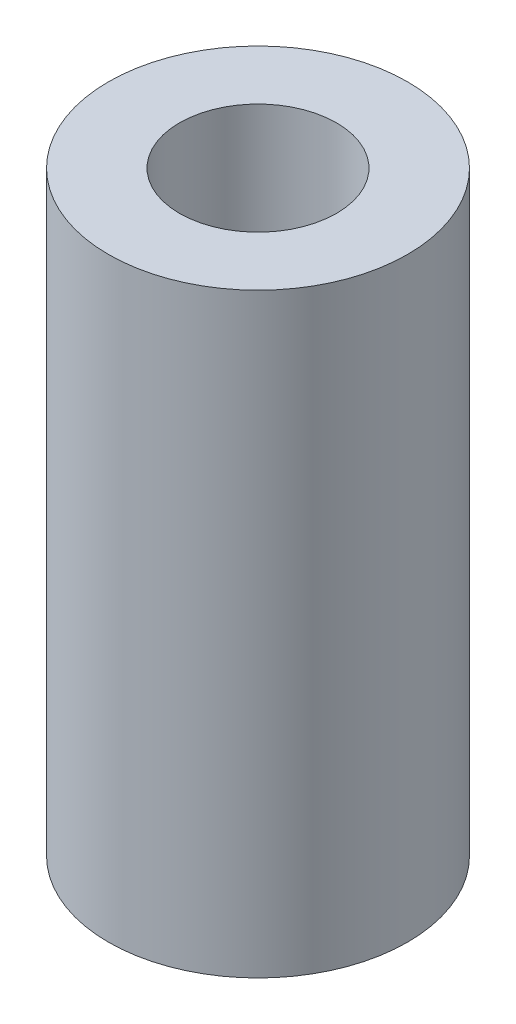
ISO-10303-21;
HEADER;
FILE_DESCRIPTION(('STEP AP214'),'2;1');
FILE_NAME('part.step','',(''),(''),'','','');
FILE_SCHEMA(('AUTOMOTIVE_DESIGN { 1 0 10303 214 1 1 1 1 }'));
ENDSEC;
DATA;
#1=APPLICATION_CONTEXT('core data for automotive mechanical design processes');
#2=APPLICATION_PROTOCOL_DEFINITION('international standard','automotive_design',2000,#1);
#3=PRODUCT_CONTEXT('',#1,'mechanical');
#4=PRODUCT('Part','Part','',(#3));
#5=PRODUCT_RELATED_PRODUCT_CATEGORY('part','',(#4));
#6=PRODUCT_DEFINITION_FORMATION('','',#4);
#7=PRODUCT_DEFINITION_CONTEXT('part definition',#1,'design');
#8=PRODUCT_DEFINITION('design','',#6,#7);
#9=PRODUCT_DEFINITION_SHAPE('','',#8);
#10=(LENGTH_UNIT() NAMED_UNIT(*) SI_UNIT(.MILLI.,.METRE.));
#11=(NAMED_UNIT(*) PLANE_ANGLE_UNIT() SI_UNIT($,.RADIAN.));
#12=(NAMED_UNIT(*) SI_UNIT($,.STERADIAN.) SOLID_ANGLE_UNIT());
#13=UNCERTAINTY_MEASURE_WITH_UNIT(LENGTH_MEASURE(1.E-05),#10,'distance_accuracy_value','');
#14=(GEOMETRIC_REPRESENTATION_CONTEXT(3) GLOBAL_UNCERTAINTY_ASSIGNED_CONTEXT((#13)) GLOBAL_UNIT_ASSIGNED_CONTEXT((#10,
#11,#12)) REPRESENTATION_CONTEXT('',''));
#15=CARTESIAN_POINT('',(0.,0.,0.));
#16=DIRECTION('',(0.,0.,1.));
#17=DIRECTION('',(1.,0.,0.));
#18=AXIS2_PLACEMENT_3D('',#15,#16,#17);
#19=CARTESIAN_POINT('',(0.,15.175,0.));
#20=DIRECTION('',(0.,1.,0.));
#21=DIRECTION('',(0.,0.,1.));
#22=AXIS2_PLACEMENT_3D('',#19,#20,#21);
#23=PLANE('',#22);
#24=CARTESIAN_POINT('',(0.,15.175,0.));
#25=DIRECTION('',(0.,1.,0.));
#26=DIRECTION('',(0.,0.,1.));
#27=AXIS2_PLACEMENT_3D('',#24,#25,#26);
#28=CIRCLE('',#27,3.81);
#29=CARTESIAN_POINT('',(0.,15.175,3.81));
#30=VERTEX_POINT('',#29);
#31=EDGE_CURVE('E10',#30,#30,#28,.T.);
#32=ORIENTED_EDGE('',*,*,#31,.T.);
#33=EDGE_LOOP('',(#32));
#34=FACE_BOUND('',#33,.T.);
#35=CARTESIAN_POINT('',(0.,15.175,0.));
#36=DIRECTION('',(0.,1.,0.));
#37=DIRECTION('',(0.,0.,1.));
#38=AXIS2_PLACEMENT_3D('',#35,#36,#37);
#39=CIRCLE('',#38,2.);
#40=CARTESIAN_POINT('',(0.,15.175,2.));
#41=VERTEX_POINT('',#40);
#42=EDGE_CURVE('E46',#41,#41,#39,.T.);
#43=ORIENTED_EDGE('',*,*,#42,.F.);
#44=EDGE_LOOP('',(#43));
#45=FACE_BOUND('',#44,.T.);
#46=ADVANCED_FACE('F35',(#34,#45),#23,.T.);
#47=CARTESIAN_POINT('',(0.,0.,0.));
#48=DIRECTION('',(0.,1.,0.));
#49=DIRECTION('',(0.,0.,1.));
#50=AXIS2_PLACEMENT_3D('',#47,#48,#49);
#51=PLANE('',#50);
#52=CARTESIAN_POINT('',(0.,0.,0.));
#53=DIRECTION('',(0.,1.,0.));
#54=DIRECTION('',(0.,0.,1.));
#55=AXIS2_PLACEMENT_3D('',#52,#53,#54);
#56=CIRCLE('',#55,3.81);
#57=CARTESIAN_POINT('',(0.,0.,3.81));
#58=VERTEX_POINT('',#57);
#59=EDGE_CURVE('E39',#58,#58,#56,.T.);
#60=ORIENTED_EDGE('',*,*,#59,.F.);
#61=EDGE_LOOP('',(#60));
#62=FACE_BOUND('',#61,.T.);
#63=CARTESIAN_POINT('',(0.,0.,0.));
#64=DIRECTION('',(0.,1.,0.));
#65=DIRECTION('',(0.,0.,1.));
#66=AXIS2_PLACEMENT_3D('',#63,#64,#65);
#67=CIRCLE('',#66,2.);
#68=CARTESIAN_POINT('',(0.,0.,2.));
#69=VERTEX_POINT('',#68);
#70=EDGE_CURVE('E48',#69,#69,#67,.T.);
#71=ORIENTED_EDGE('',*,*,#70,.T.);
#72=EDGE_LOOP('',(#71));
#73=FACE_BOUND('',#72,.T.);
#74=ADVANCED_FACE('F58',(#62,#73),#51,.F.);
#75=CARTESIAN_POINT('',(0.,15.175,0.));
#76=DIRECTION('',(0.,-1.,0.));
#77=DIRECTION('',(0.,0.,-1.));
#78=AXIS2_PLACEMENT_3D('',#75,#76,#77);
#79=CYLINDRICAL_SURFACE('',#78,3.81);
#80=ORIENTED_EDGE('',*,*,#31,.F.);
#81=EDGE_LOOP('',(#80));
#82=FACE_BOUND('',#81,.T.);
#83=ORIENTED_EDGE('',*,*,#59,.T.);
#84=EDGE_LOOP('',(#83));
#85=FACE_BOUND('',#84,.T.);
#86=ADVANCED_FACE('F37',(#82,#85),#79,.T.);
#87=CARTESIAN_POINT('',(0.,15.175,0.));
#88=DIRECTION('',(0.,-1.,0.));
#89=DIRECTION('',(0.,0.,-1.));
#90=AXIS2_PLACEMENT_3D('',#87,#88,#89);
#91=CYLINDRICAL_SURFACE('',#90,2.);
#92=ORIENTED_EDGE('',*,*,#42,.T.);
#93=EDGE_LOOP('',(#92));
#94=FACE_BOUND('',#93,.T.);
#95=ORIENTED_EDGE('',*,*,#70,.F.);
#96=EDGE_LOOP('',(#95));
#97=FACE_BOUND('',#96,.T.);
#98=ADVANCED_FACE('F54',(#94,#97),#91,.F.);
#99=CLOSED_SHELL('',(#46,#74,#86,#98));
#100=MANIFOLD_SOLID_BREP('B2',#99);
#101=ADVANCED_BREP_SHAPE_REPRESENTATION('',(#18,#100),#14);
#102=SHAPE_DEFINITION_REPRESENTATION(#9,#101);
ENDSEC;
END-ISO-10303-21;
